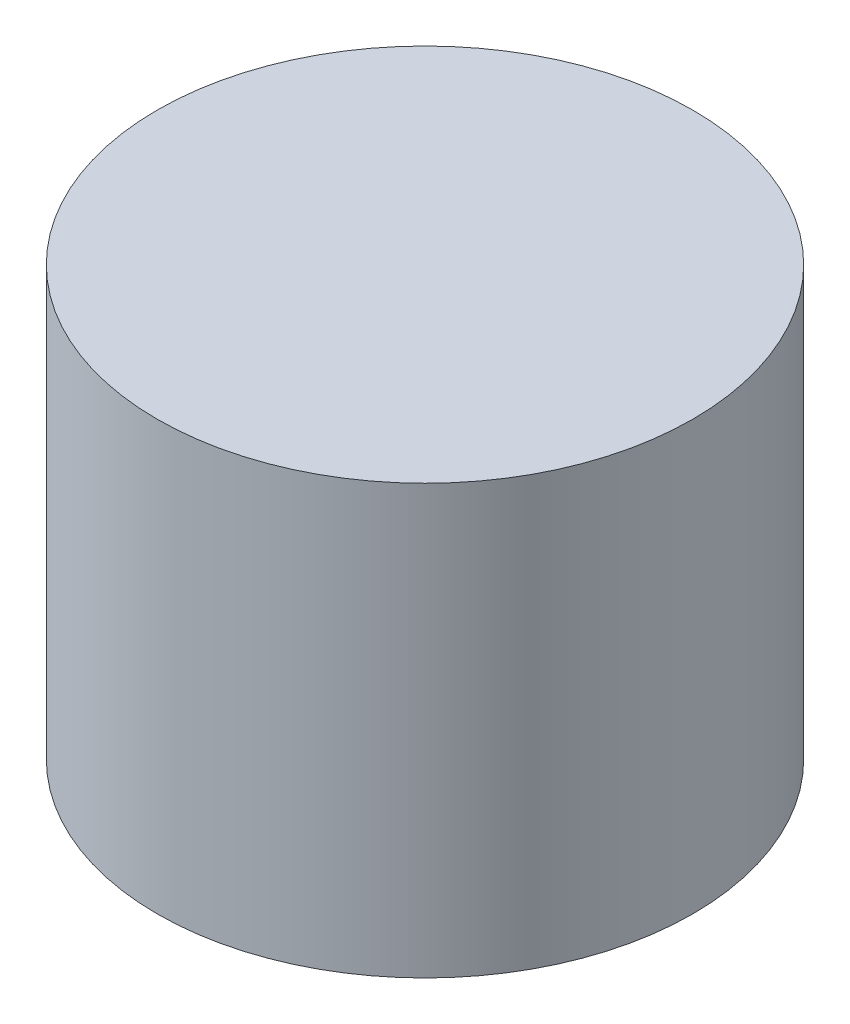
ISO-10303-21;
HEADER;
FILE_DESCRIPTION(('STEP AP214'),'2;1');
FILE_NAME('part.step','',(''),(''),'','','');
FILE_SCHEMA(('AUTOMOTIVE_DESIGN { 1 0 10303 214 1 1 1 1 }'));
ENDSEC;
DATA;
#1=APPLICATION_CONTEXT('core data for automotive mechanical design processes');
#2=APPLICATION_PROTOCOL_DEFINITION('international standard','automotive_design',2000,#1);
#3=PRODUCT_CONTEXT('',#1,'mechanical');
#4=PRODUCT('Part','Part','',(#3));
#5=PRODUCT_RELATED_PRODUCT_CATEGORY('part','',(#4));
#6=PRODUCT_DEFINITION_FORMATION('','',#4);
#7=PRODUCT_DEFINITION_CONTEXT('part definition',#1,'design');
#8=PRODUCT_DEFINITION('design','',#6,#7);
#9=PRODUCT_DEFINITION_SHAPE('','',#8);
#10=(LENGTH_UNIT() NAMED_UNIT(*) SI_UNIT(.MILLI.,.METRE.));
#11=(NAMED_UNIT(*) PLANE_ANGLE_UNIT() SI_UNIT($,.RADIAN.));
#12=(NAMED_UNIT(*) SI_UNIT($,.STERADIAN.) SOLID_ANGLE_UNIT());
#13=UNCERTAINTY_MEASURE_WITH_UNIT(LENGTH_MEASURE(1.E-05),#10,'distance_accuracy_value','');
#14=(GEOMETRIC_REPRESENTATION_CONTEXT(3) GLOBAL_UNCERTAINTY_ASSIGNED_CONTEXT((#13)) GLOBAL_UNIT_ASSIGNED_CONTEXT((#10,
#11,#12)) REPRESENTATION_CONTEXT('',''));
#15=CARTESIAN_POINT('',(0.,0.,0.));
#16=DIRECTION('',(0.,0.,1.));
#17=DIRECTION('',(1.,0.,0.));
#18=AXIS2_PLACEMENT_3D('',#15,#16,#17);
#19=CARTESIAN_POINT('',(0.,20.,0.));
#20=DIRECTION('',(0.,-1.,0.));
#21=DIRECTION('',(0.,0.,-1.));
#22=AXIS2_PLACEMENT_3D('',#19,#20,#21);
#23=CYLINDRICAL_SURFACE('',#22,12.5);
#24=CARTESIAN_POINT('',(0.,20.,0.));
#25=DIRECTION('',(0.,1.,0.));
#26=DIRECTION('',(0.,0.,1.));
#27=AXIS2_PLACEMENT_3D('',#24,#25,#26);
#28=CIRCLE('',#27,12.5);
#29=CARTESIAN_POINT('',(0.,20.,12.5));
#30=VERTEX_POINT('',#29);
#31=EDGE_CURVE('E10',#30,#30,#28,.T.);
#32=ORIENTED_EDGE('',*,*,#31,.F.);
#33=EDGE_LOOP('',(#32));
#34=FACE_BOUND('',#33,.T.);
#35=CARTESIAN_POINT('',(0.,0.,0.));
#36=DIRECTION('',(0.,1.,0.));
#37=DIRECTION('',(0.,0.,1.));
#38=AXIS2_PLACEMENT_3D('',#35,#36,#37);
#39=CIRCLE('',#38,12.5);
#40=CARTESIAN_POINT('',(0.,0.,12.5));
#41=VERTEX_POINT('',#40);
#42=EDGE_CURVE('E44',#41,#41,#39,.T.);
#43=ORIENTED_EDGE('',*,*,#42,.T.);
#44=EDGE_LOOP('',(#43));
#45=FACE_BOUND('',#44,.T.);
#46=ADVANCED_FACE('F41',(#34,#45),#23,.T.);
#47=CARTESIAN_POINT('',(0.,20.,0.));
#48=DIRECTION('',(0.,1.,0.));
#49=DIRECTION('',(0.,0.,1.));
#50=AXIS2_PLACEMENT_3D('',#47,#48,#49);
#51=PLANE('',#50);
#52=ORIENTED_EDGE('',*,*,#31,.T.);
#53=EDGE_LOOP('',(#52));
#54=FACE_BOUND('',#53,.T.);
#55=ADVANCED_FACE('F70',(#54),#51,.T.);
#56=CARTESIAN_POINT('',(0.,0.,0.));
#57=DIRECTION('',(0.,1.,0.));
#58=DIRECTION('',(0.,0.,1.));
#59=AXIS2_PLACEMENT_3D('',#56,#57,#58);
#60=PLANE('',#59);
#61=CARTESIAN_POINT('',(0.,0.,0.));
#62=DIRECTION('',(0.,-1.,0.));
#63=DIRECTION('',(0.,0.,-1.));
#64=AXIS2_PLACEMENT_3D('',#61,#62,#63);
#65=CIRCLE('',#64,2.);
#66=CARTESIAN_POINT('',(0.,0.,-2.));
#67=VERTEX_POINT('',#66);
#68=EDGE_CURVE('E53',#67,#67,#65,.T.);
#69=ORIENTED_EDGE('',*,*,#68,.F.);
#70=EDGE_LOOP('',(#69));
#71=FACE_BOUND('',#70,.T.);
#72=ORIENTED_EDGE('',*,*,#42,.F.);
#73=EDGE_LOOP('',(#72));
#74=FACE_BOUND('',#73,.T.);
#75=ADVANCED_FACE('F64',(#71,#74),#60,.F.);
#76=CARTESIAN_POINT('',(0.,5.,0.));
#77=DIRECTION('',(0.,-1.,0.));
#78=DIRECTION('',(0.,0.,-1.));
#79=AXIS2_PLACEMENT_3D('',#76,#77,#78);
#80=CYLINDRICAL_SURFACE('',#79,2.);
#81=CARTESIAN_POINT('',(0.,5.,0.));
#82=DIRECTION('',(0.,-1.,0.));
#83=DIRECTION('',(0.,0.,-1.));
#84=AXIS2_PLACEMENT_3D('',#81,#82,#83);
#85=CIRCLE('',#84,2.);
#86=CARTESIAN_POINT('',(0.,5.,-2.));
#87=VERTEX_POINT('',#86);
#88=EDGE_CURVE('E51',#87,#87,#85,.T.);
#89=ORIENTED_EDGE('',*,*,#88,.F.);
#90=EDGE_LOOP('',(#89));
#91=FACE_BOUND('',#90,.T.);
#92=ORIENTED_EDGE('',*,*,#68,.T.);
#93=EDGE_LOOP('',(#92));
#94=FACE_BOUND('',#93,.T.);
#95=ADVANCED_FACE('F61',(#91,#94),#80,.F.);
#96=CARTESIAN_POINT('',(0.,5.,0.));
#97=DIRECTION('',(0.,-1.,0.));
#98=DIRECTION('',(0.,0.,-1.));
#99=AXIS2_PLACEMENT_3D('',#96,#97,#98);
#100=PLANE('',#99);
#101=ORIENTED_EDGE('',*,*,#88,.T.);
#102=EDGE_LOOP('',(#101));
#103=FACE_BOUND('',#102,.T.);
#104=ADVANCED_FACE('F59',(#103),#100,.T.);
#105=CLOSED_SHELL('',(#46,#55,#75,#95,#104));
#106=MANIFOLD_SOLID_BREP('B2',#105);
#107=ADVANCED_BREP_SHAPE_REPRESENTATION('',(#18,#106),#14);
#108=SHAPE_DEFINITION_REPRESENTATION(#9,#107);
ENDSEC;
END-ISO-10303-21;
